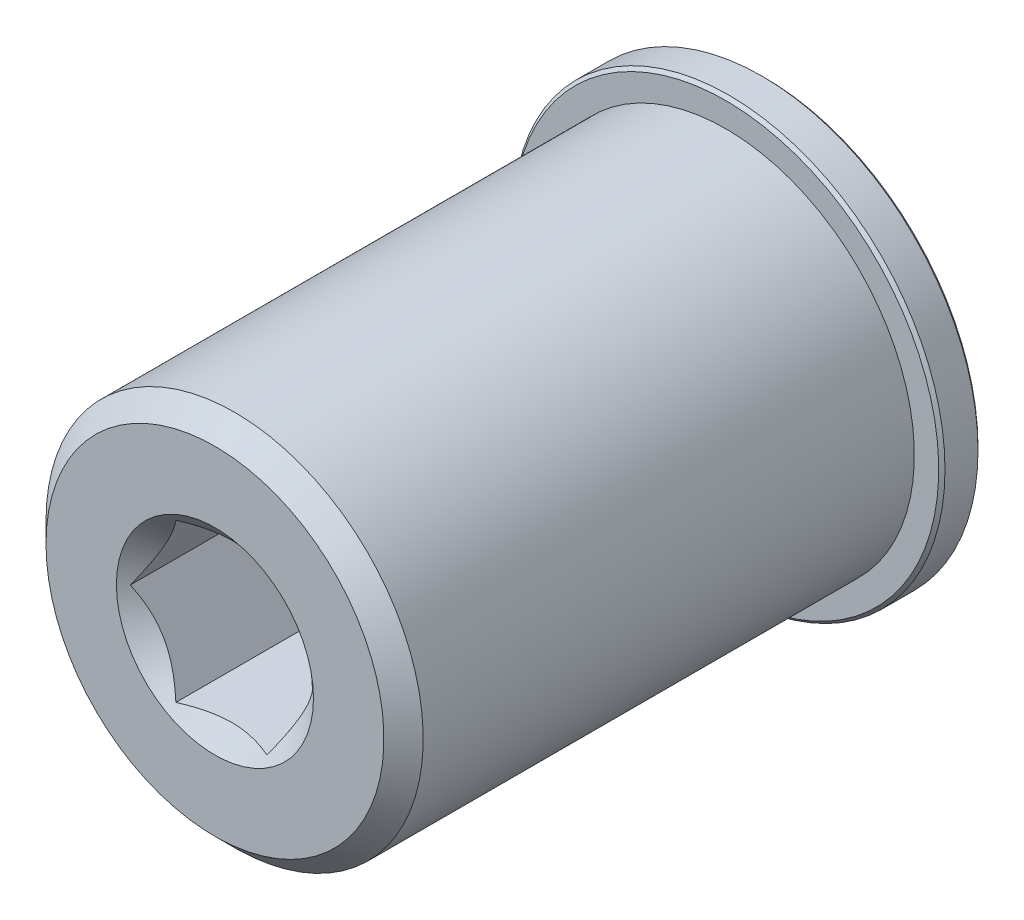
ISO-10303-21;
HEADER;
FILE_DESCRIPTION(('STEP AP214'),'2;1');
FILE_NAME('part.step','',(''),(''),'','','');
FILE_SCHEMA(('AUTOMOTIVE_DESIGN { 1 0 10303 214 1 1 1 1 }'));
ENDSEC;
DATA;
#1=APPLICATION_CONTEXT('core data for automotive mechanical design processes');
#2=APPLICATION_PROTOCOL_DEFINITION('international standard','automotive_design',2000,#1);
#3=PRODUCT_CONTEXT('',#1,'mechanical');
#4=PRODUCT('Part','Part','',(#3));
#5=PRODUCT_RELATED_PRODUCT_CATEGORY('part','',(#4));
#6=PRODUCT_DEFINITION_FORMATION('','',#4);
#7=PRODUCT_DEFINITION_CONTEXT('part definition',#1,'design');
#8=PRODUCT_DEFINITION('design','',#6,#7);
#9=PRODUCT_DEFINITION_SHAPE('','',#8);
#10=(LENGTH_UNIT() NAMED_UNIT(*) SI_UNIT(.MILLI.,.METRE.));
#11=(NAMED_UNIT(*) PLANE_ANGLE_UNIT() SI_UNIT($,.RADIAN.));
#12=(NAMED_UNIT(*) SI_UNIT($,.STERADIAN.) SOLID_ANGLE_UNIT());
#13=UNCERTAINTY_MEASURE_WITH_UNIT(LENGTH_MEASURE(1.E-05),#10,'distance_accuracy_value','');
#14=(GEOMETRIC_REPRESENTATION_CONTEXT(3) GLOBAL_UNCERTAINTY_ASSIGNED_CONTEXT((#13)) GLOBAL_UNIT_ASSIGNED_CONTEXT((#10,
#11,#12)) REPRESENTATION_CONTEXT('',''));
#15=CARTESIAN_POINT('',(0.,0.,0.));
#16=DIRECTION('',(0.,0.,1.));
#17=DIRECTION('',(1.,0.,0.));
#18=AXIS2_PLACEMENT_3D('',#15,#16,#17);
#19=CARTESIAN_POINT('',(0.,0.,-4.7625));
#20=DIRECTION('',(0.,0.,1.));
#21=DIRECTION('',(1.,0.,0.));
#22=AXIS2_PLACEMENT_3D('',#19,#20,#21);
#23=CYLINDRICAL_SURFACE('',#22,9.525);
#24=CARTESIAN_POINT('',(0.,0.,-2.38125));
#25=DIRECTION('',(0.,0.,1.));
#26=DIRECTION('',(1.,0.,0.));
#27=AXIS2_PLACEMENT_3D('',#24,#25,#26);
#28=CIRCLE('',#27,9.525);
#29=CARTESIAN_POINT('',(9.525,0.,-2.38125));
#30=VERTEX_POINT('',#29);
#31=EDGE_CURVE('E132',#30,#30,#28,.F.);
#32=ORIENTED_EDGE('',*,*,#31,.T.);
#33=EDGE_LOOP('',(#32));
#34=FACE_BOUND('',#33,.T.);
#35=CARTESIAN_POINT('',(0.,0.,-4.7625));
#36=DIRECTION('',(0.,0.,1.));
#37=DIRECTION('',(1.,0.,0.));
#38=AXIS2_PLACEMENT_3D('',#35,#36,#37);
#39=CIRCLE('',#38,9.525);
#40=CARTESIAN_POINT('',(9.525,0.,-4.7625));
#41=VERTEX_POINT('',#40);
#42=EDGE_CURVE('E139',#41,#41,#39,.F.);
#43=ORIENTED_EDGE('',*,*,#42,.F.);
#44=EDGE_LOOP('',(#43));
#45=FACE_BOUND('',#44,.T.);
#46=ADVANCED_FACE('F17',(#34,#45),#23,.T.);
#47=CARTESIAN_POINT('',(0.,0.,-4.7625));
#48=DIRECTION('',(0.,0.,-1.));
#49=DIRECTION('',(-1.,0.,0.));
#50=AXIS2_PLACEMENT_3D('',#47,#48,#49);
#51=PLANE('',#50);
#52=ORIENTED_EDGE('',*,*,#42,.T.);
#53=EDGE_LOOP('',(#52));
#54=FACE_BOUND('',#53,.T.);
#55=CARTESIAN_POINT('',(0.,0.,-4.76250000002665));
#56=DIRECTION('',(0.,0.,-1.));
#57=DIRECTION('',(-1.,0.,0.));
#58=AXIS2_PLACEMENT_3D('',#55,#56,#57);
#59=CIRCLE('',#58,7.96289999999544);
#60=CARTESIAN_POINT('',(-7.96289999999544,0.,-4.76250000002665));
#61=VERTEX_POINT('',#60);
#62=EDGE_CURVE('E91',#61,#61,#59,.F.);
#63=ORIENTED_EDGE('',*,*,#62,.T.);
#64=EDGE_LOOP('',(#63));
#65=FACE_BOUND('',#64,.T.);
#66=ADVANCED_FACE('F126',(#54,#65),#51,.T.);
#67=CARTESIAN_POINT('',(0.,0.,-2.38125));
#68=DIRECTION('',(0.,0.,1.));
#69=DIRECTION('',(1.,0.,0.));
#70=AXIS2_PLACEMENT_3D('',#67,#68,#69);
#71=TOROIDAL_SURFACE('',#70,10.31875,0.79375);
#72=CARTESIAN_POINT('',(0.,0.,-1.5875));
#73=DIRECTION('',(0.,0.,-1.));
#74=DIRECTION('',(-1.,0.,0.));
#75=AXIS2_PLACEMENT_3D('',#72,#73,#74);
#76=CIRCLE('',#75,10.31875);
#77=CARTESIAN_POINT('',(-10.31875,0.,-1.5875));
#78=VERTEX_POINT('',#77);
#79=CARTESIAN_POINT('',(10.31875,0.,-1.5875));
#80=VERTEX_POINT('',#79);
#81=EDGE_CURVE('E80',#78,#80,#76,.T.);
#82=ORIENTED_EDGE('',*,*,#81,.T.);
#83=CARTESIAN_POINT('',(0.,0.,-1.5875));
#84=DIRECTION('',(0.,0.,-1.));
#85=DIRECTION('',(1.,0.,0.));
#86=AXIS2_PLACEMENT_3D('',#83,#84,#85);
#87=CIRCLE('',#86,10.31875);
#88=EDGE_CURVE('E77',#80,#78,#87,.T.);
#89=ORIENTED_EDGE('',*,*,#88,.T.);
#90=EDGE_LOOP('',(#82,#89));
#91=FACE_BOUND('',#90,.T.);
#92=ORIENTED_EDGE('',*,*,#31,.F.);
#93=EDGE_LOOP('',(#92));
#94=FACE_BOUND('',#93,.T.);
#95=ADVANCED_FACE('F82',(#91,#94),#71,.F.);
#96=CARTESIAN_POINT('',(0.,0.,-4.76250000002665));
#97=DIRECTION('',(0.,0.,-1.));
#98=DIRECTION('',(-1.,0.,0.));
#99=AXIS2_PLACEMENT_3D('',#96,#97,#98);
#100=CONICAL_SURFACE('',#99,7.96289999999544,0.855211333477452);
#101=CARTESIAN_POINT('',(-7.3616778123846,-2.63528657081422E-12,-4.23986552585593));
#102=CARTESIAN_POINT('',(-7.29004239027056,0.124076190720529,-4.17760950951665));
#103=CARTESIAN_POINT('',(-7.21792012000924,0.248995627170353,-4.11762732986379));
#104=CARTESIAN_POINT('',(-7.07259135551525,0.500712431075146,-4.00292131524244));
#105=CARTESIAN_POINT('',(-6.99938425231083,0.627510853300148,-3.94820057364377));
#106=CARTESIAN_POINT('',(-6.77739365970753,1.01200983849139,-3.79261125749645));
#107=CARTESIAN_POINT('',(-6.62692217510879,1.27263409490672,-3.70092335318642));
#108=CARTESIAN_POINT('',(-6.39965769697561,1.66626771778901,-3.58771533259242));
#109=CARTESIAN_POINT('',(-6.32432915845011,1.7967405737751,-3.55422930937036));
#110=CARTESIAN_POINT('',(-6.17286564439137,2.05908307561774,-3.49565360948011));
#111=CARTESIAN_POINT('',(-6.09673085582295,2.19095239764176,-3.47056202834743));
#112=CARTESIAN_POINT('',(-5.94400716513701,2.45547758942924,-3.42949545828135));
#113=CARTESIAN_POINT('',(-5.86741953841224,2.58813125014767,-3.4135015984778));
#114=CARTESIAN_POINT('',(-5.71389700672629,2.85404007513434,-3.39102574565883));
#115=CARTESIAN_POINT('',(-5.63696212735227,2.98729519508432,-3.38454306293328));
#116=CARTESIAN_POINT('',(-5.49370096180016,3.23543081257212,-3.38151546183364));
#117=CARTESIAN_POINT('',(-5.42738078688849,3.35030072508599,-3.38371880674214));
#118=CARTESIAN_POINT('',(-5.29489368860524,3.57977511065994,-3.39527039344533));
#119=CARTESIAN_POINT('',(-5.22872678424425,3.69437955079273,-3.40461947845364));
#120=CARTESIAN_POINT('',(-5.03065980502729,4.03744162209818,-3.44312816670664));
#121=CARTESIAN_POINT('',(-4.89924027787976,4.26506692022439,-3.48274997989528));
#122=CARTESIAN_POINT('',(-4.63890375189526,4.71598301029552,-3.5866639017883));
#123=CARTESIAN_POINT('',(-4.5099876714464,4.93927221154557,-3.65096489089519));
#124=CARTESIAN_POINT('',(-4.25521793266326,5.38054634334902,-3.7999586928834));
#125=CARTESIAN_POINT('',(-4.12936332427187,5.59853291944959,-3.88464508839333));
#126=CARTESIAN_POINT('',(-3.95037009848282,5.90855828072689,-4.01831099189156));
#127=CARTESIAN_POINT('',(-3.89597323215211,6.00277641698421,-4.06073329598283));
#128=CARTESIAN_POINT('',(-3.78790717201407,6.18995232371709,-4.14830750904034));
#129=CARTESIAN_POINT('',(-3.73423637395795,6.28291287283305,-4.19345148984713));
#130=CARTESIAN_POINT('',(-3.68083890619712,6.37539999999033,-4.23986552584973));
#131=B_SPLINE_CURVE_WITH_KNOTS('',3,(#101,#102,#103,#104,#105,#106,#107,#108,#109,#110,#111,
#112,#113,#114,#115,#116,#117,#118,#119,#120,#121,#122,#123,#124,#125,#126,#127,#128,#129,#130),
.UNSPECIFIED.,.F.,.F.,(4,2,2,2,2,2,2,2,2,2,2,2,2,2,4),(0.,0.468576880349405,0.937427588926757,
1.87959426250024,2.34240552649953,2.80511172023072,3.26685461664367,3.72856402776934,
4.12634319823278,4.52416931479329,5.32010098640453,6.11631933008333,6.91228734949568,
7.26257509662187,7.61188762626727),.UNSPECIFIED.);
#132=CARTESIAN_POINT('',(-7.36167781235508,0.,-4.23986552581823));
#133=VERTEX_POINT('',#132);
#134=CARTESIAN_POINT('',(-3.68083890618589,6.3754,-4.23986552585215));
#135=VERTEX_POINT('',#134);
#136=EDGE_CURVE('E180',#133,#135,#131,.T.);
#137=ORIENTED_EDGE('',*,*,#136,.F.);
#138=CARTESIAN_POINT('',(-3.68083890619944,-6.37539999999398,-4.23986552584482));
#139=CARTESIAN_POINT('',(-3.75247432831102,-6.25132380927024,-4.17760950950698));
#140=CARTESIAN_POINT('',(-3.82459659857095,-6.12640437282078,-4.11762732985486));
#141=CARTESIAN_POINT('',(-3.96992536306312,-5.87468756891757,-4.00292131523431));
#142=CARTESIAN_POINT('',(-4.04313246626713,-5.7478891466938,-3.94820057363571));
#143=CARTESIAN_POINT('',(-4.26512305886891,-5.363390161506,-3.79261125748867));
#144=CARTESIAN_POINT('',(-4.41559454346625,-5.10276590509266,-3.70092335317894));
#145=CARTESIAN_POINT('',(-4.64285902159753,-4.7091322822135,-3.58771533258501));
#146=CARTESIAN_POINT('',(-4.71818756012245,-4.57865942622847,-3.55422930936292));
#147=CARTESIAN_POINT('',(-4.86965107417998,-4.31631692438792,-3.49565360947253));
#148=CARTESIAN_POINT('',(-4.9457858627478,-4.18444760236494,-3.47056202833973));
#149=CARTESIAN_POINT('',(-5.09850955343253,-3.91992241057954,-3.42949545827333));
#150=CARTESIAN_POINT('',(-5.1750971801567,-3.78726874986216,-3.41350159846958));
#151=CARTESIAN_POINT('',(-5.32861971184147,-3.52135992487755,-3.39102574565011));
#152=CARTESIAN_POINT('',(-5.40555459121489,-3.3881048049286,-3.38454306292426));
#153=CARTESIAN_POINT('',(-5.54881575676605,-3.13996918744245,-3.38151546182399));
#154=CARTESIAN_POINT('',(-5.61513593167736,-3.02509927492921,-3.38371880673219));
#155=CARTESIAN_POINT('',(-5.74762302995989,-2.7956248893565,-3.39527039343474));
#156=CARTESIAN_POINT('',(-5.81378993432053,-2.68102044922432,-3.40461947844271));
#157=CARTESIAN_POINT('',(-6.01185691353644,-2.33795837792068,-3.4431281666947));
#158=CARTESIAN_POINT('',(-6.14327644068328,-2.11033307979566,-3.48274997988263));
#159=CARTESIAN_POINT('',(-6.40361296666646,-1.65941698972683,-3.58666390177423));
#160=CARTESIAN_POINT('',(-6.53252904711467,-1.43612778847789,-3.65096489088042));
#161=CARTESIAN_POINT('',(-6.78729878589651,-0.994853656676678,-3.79995869286725));
#162=CARTESIAN_POINT('',(-6.91315339428726,-0.776867080577217,-3.88464508837652));
#163=CARTESIAN_POINT('',(-7.09214662007977,-0.466841719293955,-4.01831099187708));
#164=CARTESIAN_POINT('',(-7.14654348641451,-0.372623583029643,-4.06073329597159));
#165=CARTESIAN_POINT('',(-7.25460954656051,-0.185447676282974,-4.14830750903599));
#166=CARTESIAN_POINT('',(-7.30828034462056,-0.0924871271602104,-4.19345148984644));
#167=CARTESIAN_POINT('',(-7.36167781238526,3.78631816897511E-12,-4.23986552585288));
#168=B_SPLINE_CURVE_WITH_KNOTS('',3,(#138,#139,#140,#141,#142,#143,#144,#145,#146,#147,#148,
#149,#150,#151,#152,#153,#154,#155,#156,#157,#158,#159,#160,#161,#162,#163,#164,#165,#166,#167),
.UNSPECIFIED.,.F.,.F.,(4,2,2,2,2,2,2,2,2,2,2,2,2,2,4),(0.,0.468576880345747,0.937427588919474,
1.87959426248574,2.34240552648152,2.80511172020919,3.26685461661863,3.72856402774079,
4.12634319820204,4.52416931476037,5.32010098636724,6.11631933004176,6.91228734944982,
7.26257509660209,7.61188762627343),.UNSPECIFIED.);
#169=CARTESIAN_POINT('',(-3.68083890618905,-6.37539999999568,-4.23986552584667));
#170=VERTEX_POINT('',#169);
#171=EDGE_CURVE('E204',#170,#133,#168,.T.);
#172=ORIENTED_EDGE('',*,*,#171,.F.);
#173=CARTESIAN_POINT('',(3.68083890618237,-6.37540000000384,-4.23986552584482));
#174=CARTESIAN_POINT('',(3.53756806195502,-6.37540000000141,-4.17760950950698));
#175=CARTESIAN_POINT('',(3.3933235214334,-6.37540000000039,-4.11762732985486));
#176=CARTESIAN_POINT('',(3.10266599244773,-6.37539999999961,-4.00292131523432));
#177=CARTESIAN_POINT('',(2.95625178604016,-6.37539999999987,-3.94820057363573));
#178=CARTESIAN_POINT('',(2.51227060083732,-6.37540000000027,-3.79261125748869));
#179=CARTESIAN_POINT('',(2.21132763164229,-6.37540000000005,-3.70092335317896));
#180=CARTESIAN_POINT('',(1.75679867537959,-6.37539999999998,-3.58771533258503));
#181=CARTESIAN_POINT('',(1.60614159832978,-6.37539999999999,-3.55422930936294));
#182=CARTESIAN_POINT('',(1.30321457021472,-6.37540000000001,-3.49565360947254));
#183=CARTESIAN_POINT('',(1.15094499307908,-6.3754,-3.47056202833974));
#184=CARTESIAN_POINT('',(0.845497611709588,-6.3754,-3.42949545827333));
#185=CARTESIAN_POINT('',(0.692322358261239,-6.3754,-3.41350159846958));
#186=CARTESIAN_POINT('',(0.385277294891703,-6.3754,-3.39102574565011));
#187=CARTESIAN_POINT('',(0.231407536144847,-6.3754,-3.38454306292426));
#188=CARTESIAN_POINT('',(-0.055114794957487,-6.3754,-3.38151546182399));
#189=CARTESIAN_POINT('',(-0.187755144780104,-6.3754,-3.38371880673219));
#190=CARTESIAN_POINT('',(-0.452729341345175,-6.3754,-3.39527039343474));
#191=CARTESIAN_POINT('',(-0.585063150066458,-6.3754,-3.40461947844272));
#192=CARTESIAN_POINT('',(-0.981197108498285,-6.3754,-3.44312816669471));
#193=CARTESIAN_POINT('',(-1.24403616279199,-6.3754,-3.48274997988264));
#194=CARTESIAN_POINT('',(-1.76470921475833,-6.3754,-3.58666390177424));
#195=CARTESIAN_POINT('',(-2.02254137565474,-6.3754,-3.65096489088043));
#196=CARTESIAN_POINT('',(-2.53208085321843,-6.3754,-3.79995869286725));
#197=CARTESIAN_POINT('',(-2.78379006999992,-6.3754,-3.88464508837652));
#198=CARTESIAN_POINT('',(-3.14177652158248,-6.3754,-4.01831099187618));
#199=CARTESIAN_POINT('',(-3.25057025424957,-6.3754,-4.0607332959697));
#200=CARTESIAN_POINT('',(-3.46670237453683,-6.3754,-4.14830750903204));
#201=CARTESIAN_POINT('',(-3.57404397065458,-6.3754,-4.1934514898414));
#202=CARTESIAN_POINT('',(-3.68083890618168,-6.3754,-4.23986552584669));
#203=B_SPLINE_CURVE_WITH_KNOTS('',3,(#173,#174,#175,#176,#177,#178,#179,#180,#181,#182,#183,
#184,#185,#186,#187,#188,#189,#190,#191,#192,#193,#194,#195,#196,#197,#198,#199,#200,#201,#202),
.UNSPECIFIED.,.F.,.F.,(4,2,2,2,2,2,2,2,2,2,2,2,2,2,4),(0.,0.468576880345723,0.937427588919427,
1.87959426248564,2.34240552648145,2.80511172020915,3.26685461661861,3.72856402774079,
4.12634319820205,4.52416931476039,5.32010098636729,6.11631933004178,6.91228734944981,
7.26257509659431,7.61188762625791),.UNSPECIFIED.);
#204=CARTESIAN_POINT('',(3.68083890618655,-6.3754,-4.23986552584883));
#205=VERTEX_POINT('',#204);
#206=EDGE_CURVE('E69',#205,#170,#203,.T.);
#207=ORIENTED_EDGE('',*,*,#206,.F.);
#208=CARTESIAN_POINT('',(7.36167781238526,3.77757446666981E-12,-4.23986552585289));
#209=CARTESIAN_POINT('',(7.29004239027164,-0.124076190718656,-4.17760950951353));
#210=CARTESIAN_POINT('',(7.21792012001074,-0.248995627167748,-4.11762732986058));
#211=CARTESIAN_POINT('',(7.0725913555176,-0.50071243107108,-4.00292131523899));
#212=CARTESIAN_POINT('',(6.9993842523136,-0.62751085329535,-3.94820057364019));
#213=CARTESIAN_POINT('',(6.77739365971156,-1.0120098384844,-3.79261125749238));
#214=CARTESIAN_POINT('',(6.62692217511366,-1.27263409489828,-3.70092335318193));
#215=CARTESIAN_POINT('',(6.39965769698172,-1.66626771777843,-3.58771533258715));
#216=CARTESIAN_POINT('',(6.32432915845662,-1.79674057376382,-3.5542293093648));
#217=CARTESIAN_POINT('',(6.17286564439869,-2.05908307560508,-3.49565360947393));
#218=CARTESIAN_POINT('',(6.09673085583066,-2.19095239762841,-3.47056202834091));
#219=CARTESIAN_POINT('',(5.9440071651455,-2.45547758941454,-3.4294954582741));
#220=CARTESIAN_POINT('',(5.86741953842112,-2.58813125013229,-3.41350159847017));
#221=CARTESIAN_POINT('',(5.71389700673592,-2.85404007511766,-3.39102574565039));
#222=CARTESIAN_POINT('',(5.63696212736228,-2.98729519506699,-3.38454306292441));
#223=CARTESIAN_POINT('',(5.49370096181078,-3.23543081255373,-3.38151546182395));
#224=CARTESIAN_POINT('',(5.42738078689935,-3.35030072506717,-3.38371880673207));
#225=CARTESIAN_POINT('',(5.29489368861659,-3.57977511064029,-3.3952703934345));
#226=CARTESIAN_POINT('',(5.22872678425583,-3.69437955077268,-3.40461947844243));
#227=CARTESIAN_POINT('',(5.03065980503956,-4.03744162207693,-3.44312816669432));
#228=CARTESIAN_POINT('',(4.89924027789248,-4.26506692020236,-3.48274997988223));
#229=CARTESIAN_POINT('',(4.63890375190885,-4.71598301027199,-3.58666390177389));
#230=CARTESIAN_POINT('',(4.50998767146042,-4.93927221152131,-3.65096489088016));
#231=CARTESIAN_POINT('',(4.25521793267813,-5.38054634332328,-3.79995869286722));
#232=CARTESIAN_POINT('',(4.12936332428717,-5.59853291942311,-3.88464508837664));
#233=CARTESIAN_POINT('',(3.95037009849574,-5.90855828070451,-4.01831099187643));
#234=CARTESIAN_POINT('',(3.89597323216226,-6.00277641696662,-4.06073329596991));
#235=CARTESIAN_POINT('',(3.78790717201876,-6.18995232370896,-4.14830750903215));
#236=CARTESIAN_POINT('',(3.73423637395995,-6.28291287282958,-4.19345148984145));
#237=CARTESIAN_POINT('',(3.68083890619647,-6.37539999999146,-4.23986552584669));
#238=B_SPLINE_CURVE_WITH_KNOTS('',3,(#208,#209,#210,#211,#212,#213,#214,#215,#216,#217,#218,
#219,#220,#221,#222,#223,#224,#225,#226,#227,#228,#229,#230,#231,#232,#233,#234,#235,#236,#237),
.UNSPECIFIED.,.F.,.F.,(4,2,2,2,2,2,2,2,2,2,2,2,2,2,4),(0.,0.468576880347178,0.937427588922303,
1.87959426249134,2.34240552648846,2.80511172021746,3.26685461662824,3.72856402775173,
4.12634319821368,4.52416931477271,5.32010098638097,6.11631933005684,6.91228734946625,
7.26257509661032,7.6118876262735),.UNSPECIFIED.);
#239=CARTESIAN_POINT('',(7.36167781234787,0.,-4.23986552581823));
#240=VERTEX_POINT('',#239);
#241=EDGE_CURVE('E258',#240,#205,#238,.T.);
#242=ORIENTED_EDGE('',*,*,#241,.F.);
#243=CARTESIAN_POINT('',(3.68083890620049,6.37539999999319,-4.23986552584761));
#244=CARTESIAN_POINT('',(3.75247432831225,6.25132380926849,-4.17760950951));
#245=CARTESIAN_POINT('',(3.8245965985725,6.1264043728182,-4.11762732985804));
#246=CARTESIAN_POINT('',(3.96992536306545,5.87468756891344,-4.00292131523777));
#247=CARTESIAN_POINT('',(4.04313246626992,5.74788914668895,-3.94820057363929));
#248=CARTESIAN_POINT('',(4.26512305887301,5.36339016149897,-3.79261125749269));
#249=CARTESIAN_POINT('',(4.41559454347118,5.10276590508412,-3.70092335318339));
#250=CARTESIAN_POINT('',(4.64285902160372,4.70913228220278,-3.58771533259025));
#251=CARTESIAN_POINT('',(4.71818756012905,4.57865942621704,-3.55422930936844));
#252=CARTESIAN_POINT('',(4.8696510741874,4.31631692437508,-3.49565360947867));
#253=CARTESIAN_POINT('',(4.94578586275562,4.1844476023514,-3.47056202834622));
#254=CARTESIAN_POINT('',(5.09850955344115,3.91992241056462,-3.42949545828055));
#255=CARTESIAN_POINT('',(5.17509718016571,3.78726874984656,-3.41350159847718));
#256=CARTESIAN_POINT('',(5.32861971185125,3.52135992486061,-3.39102574565854));
#257=CARTESIAN_POINT('',(5.40555459122505,3.388104804911,-3.38454306293312));
#258=CARTESIAN_POINT('',(5.54881575677683,3.13996918742377,-3.38151546183368));
#259=CARTESIAN_POINT('',(5.61513593168839,3.02509927491011,-3.38371880674226));
#260=CARTESIAN_POINT('',(5.7476230299714,2.79562488933656,-3.39527039344558));
#261=CARTESIAN_POINT('',(5.81378993433227,2.68102044920398,-3.40461947845395));
#262=CARTESIAN_POINT('',(6.01185691354887,2.33795837789913,-3.44312816670707));
#263=CARTESIAN_POINT('',(6.14327644069617,2.11033307977334,-3.48274997989574));
#264=CARTESIAN_POINT('',(6.40361296668021,1.65941698970301,-3.58666390178871));
#265=CARTESIAN_POINT('',(6.53252904712885,1.43612778845333,-3.65096489089554));
#266=CARTESIAN_POINT('',(6.78729878591155,0.994853656650642,-3.79995869288353));
#267=CARTESIAN_POINT('',(6.91315339430272,0.776867080550441,-3.88464508839333));
#268=CARTESIAN_POINT('',(7.09214662009283,0.466841719271337,-4.01831099189232));
#269=CARTESIAN_POINT('',(7.14654348642477,0.372623583011873,-4.06073329598459));
#270=CARTESIAN_POINT('',(7.25460954656526,0.185447676274758,-4.14830750904423));
#271=CARTESIAN_POINT('',(7.30828034462258,0.0924871271567012,-4.19345148985214));
#272=CARTESIAN_POINT('',(7.3616778123846,-2.64231672638382E-12,-4.23986552585591));
#273=B_SPLINE_CURVE_WITH_KNOTS('',3,(#243,#244,#245,#246,#247,#248,#249,#250,#251,#252,#253,
#254,#255,#256,#257,#258,#259,#260,#261,#262,#263,#264,#265,#266,#267,#268,#269,#270,#271,#272),
.UNSPECIFIED.,.F.,.F.,(4,2,2,2,2,2,2,2,2,2,2,2,2,2,4),(0.,0.468576880348005,0.937427588923997,
1.87959426249479,2.3424055264928,2.80511172022269,3.26685461663435,3.72856402775872,
4.12634319822147,4.52416931478129,5.32010098639115,6.11631933006861,6.91228734947962,
7.26257509661382,7.61188762626719),.UNSPECIFIED.);
#274=CARTESIAN_POINT('',(3.68083890619436,6.37539999999511,-4.23986552585215));
#275=VERTEX_POINT('',#274);
#276=EDGE_CURVE('E198',#275,#240,#273,.T.);
#277=ORIENTED_EDGE('',*,*,#276,.F.);
#278=CARTESIAN_POINT('',(-3.68083890618116,6.37540000000434,-4.23986552584761));
#279=CARTESIAN_POINT('',(-3.53756806195289,6.3754000000016,-4.17760950951));
#280=CARTESIAN_POINT('',(-3.39332352143039,6.37540000000044,-4.11762732985804));
#281=CARTESIAN_POINT('',(-3.10266599244299,6.37539999999956,-4.00292131523778));
#282=CARTESIAN_POINT('',(-2.95625178603457,6.37539999999985,-3.9482005736393));
#283=CARTESIAN_POINT('',(-2.51227060082918,6.3754000000003,-3.79261125749271));
#284=CARTESIAN_POINT('',(-2.21132763163243,6.37540000000006,-3.70092335318341));
#285=CARTESIAN_POINT('',(-1.75679867536722,6.37539999999998,-3.58771533259027));
#286=CARTESIAN_POINT('',(-1.60614159831659,6.37539999999999,-3.55422930936846));
#287=CARTESIAN_POINT('',(-1.3032145701999,6.37540000000001,-3.49565360947868));
#288=CARTESIAN_POINT('',(-1.15094499306344,6.3754,-3.47056202834623));
#289=CARTESIAN_POINT('',(-0.84549761169236,6.3754,-3.42949545828055));
#290=CARTESIAN_POINT('',(-0.692322358243226,6.3754,-3.41350159847719));
#291=CARTESIAN_POINT('',(-0.385277294872146,6.3754,-3.39102574565854));
#292=CARTESIAN_POINT('',(-0.23140753612453,6.3754,-3.38454306293312));
#293=CARTESIAN_POINT('',(0.0551147949790487,6.3754,-3.38151546183368));
#294=CARTESIAN_POINT('',(0.187755144802155,6.3754,-3.38371880674226));
#295=CARTESIAN_POINT('',(0.452729341368187,6.3754,-3.39527039344559));
#296=CARTESIAN_POINT('',(0.58506315008994,6.3754,-3.40461947845395));
#297=CARTESIAN_POINT('',(0.981197108523156,6.3754,-3.44312816670708));
#298=CARTESIAN_POINT('',(1.24403616281776,6.3754,-3.48274997989575));
#299=CARTESIAN_POINT('',(1.76470921478584,6.3754,-3.58666390178872));
#300=CARTESIAN_POINT('',(2.0225413756831,6.3754,-3.65096489089554));
#301=CARTESIAN_POINT('',(2.53208085324849,6.3754,-3.79995869288354));
#302=CARTESIAN_POINT('',(2.78379007003083,6.3754,-3.88464508839333));
#303=CARTESIAN_POINT('',(3.1417765216086,6.3754,-4.01831099189141));
#304=CARTESIAN_POINT('',(3.25057025427009,6.3754,-4.06073329598271));
#305=CARTESIAN_POINT('',(3.46670237454633,6.3754,-4.14830750904028));
#306=CARTESIAN_POINT('',(3.57404397065864,6.3754,-4.1934514898471));
#307=CARTESIAN_POINT('',(3.68083890618037,6.3754,-4.23986552584974));
#308=B_SPLINE_CURVE_WITH_KNOTS('',3,(#278,#279,#280,#281,#282,#283,#284,#285,#286,#287,#288,
#289,#290,#291,#292,#293,#294,#295,#296,#297,#298,#299,#300,#301,#302,#303,#304,#305,#306,#307),
.UNSPECIFIED.,.F.,.F.,(4,2,2,2,2,2,2,2,2,2,2,2,2,2,4),(0.,0.468576880347981,0.937427588923948,
1.87959426249469,2.34240552649272,2.80511172022264,3.26685461663432,3.72856402775872,
4.12634319822148,4.5241693147813,5.32010098639119,6.11631933006863,6.91228734947961,
7.26257509660604,7.61188762625168),.UNSPECIFIED.);
#309=EDGE_CURVE('E190',#135,#275,#308,.T.);
#310=ORIENTED_EDGE('',*,*,#309,.F.);
#311=EDGE_LOOP('',(#137,#172,#207,#242,#277,#310));
#312=FACE_BOUND('',#311,.T.);
#313=ORIENTED_EDGE('',*,*,#62,.F.);
#314=EDGE_LOOP('',(#313));
#315=FACE_BOUND('',#314,.T.);
#316=ADVANCED_FACE('F110',(#312,#315),#100,.F.);
#317=CARTESIAN_POINT('',(0.,0.,-1.5875));
#318=DIRECTION('',(0.,0.,1.));
#319=DIRECTION('',(1.,0.,0.));
#320=AXIS2_PLACEMENT_3D('',#317,#318,#319);
#321=PLANE('',#320);
#322=ORIENTED_EDGE('',*,*,#88,.F.);
#323=ORIENTED_EDGE('',*,*,#81,.F.);
#324=EDGE_LOOP('',(#322,#323));
#325=FACE_BOUND('',#324,.T.);
#326=CARTESIAN_POINT('',(0.,0.,-1.5875));
#327=DIRECTION('',(0.,0.,1.));
#328=DIRECTION('',(1.,0.,0.));
#329=AXIS2_PLACEMENT_3D('',#326,#327,#328);
#330=CIRCLE('',#329,17.2085);
#331=CARTESIAN_POINT('',(17.2085,0.,-1.5875));
#332=VERTEX_POINT('',#331);
#333=EDGE_CURVE('E188',#332,#332,#330,.T.);
#334=ORIENTED_EDGE('',*,*,#333,.F.);
#335=EDGE_LOOP('',(#334));
#336=FACE_BOUND('',#335,.T.);
#337=ADVANCED_FACE('F89',(#325,#336),#321,.F.);
#338=CARTESIAN_POINT('',(3.68083890619154,-6.3754,-4.7625));
#339=DIRECTION('',(0.,1.,0.));
#340=DIRECTION('',(-1.,0.,0.));
#341=AXIS2_PLACEMENT_3D('',#338,#339,#340);
#342=PLANE('',#341);
#343=ORIENTED_EDGE('',*,*,#206,.T.);
#344=DIRECTION('',(0.,0.,1.));
#345=VECTOR('',#344,1.);
#346=CARTESIAN_POINT('',(-3.68083890619154,-6.3754,-4.7625));
#347=LINE('',#346,#345);
#348=CARTESIAN_POINT('',(-3.680838901253,-6.37540000855381,42.3398655300844));
#349=VERTEX_POINT('',#348);
#350=EDGE_CURVE('E256',#349,#170,#347,.F.);
#351=ORIENTED_EDGE('',*,*,#350,.F.);
#352=CARTESIAN_POINT('',(-3.68083883074579,-6.37539999999488,42.3398654930023));
#353=CARTESIAN_POINT('',(-3.53756798891934,-6.37539999999812,42.2776094786603));
#354=CARTESIAN_POINT('',(-3.39332345082502,-6.37539999999948,42.2176273009769));
#355=CARTESIAN_POINT('',(-3.10266592676703,-6.37540000000052,42.1029212902102));
#356=CARTESIAN_POINT('',(-2.95625172285992,-6.37540000000018,42.0482005504965));
#357=CARTESIAN_POINT('',(-2.51227054540028,-6.37539999999964,41.8926112398764));
#358=CARTESIAN_POINT('',(-2.2113275815788,-6.37539999999994,41.8009233390215));
#359=CARTESIAN_POINT('',(-1.75679863347065,-6.37540000000003,41.6877153228819));
#360=CARTESIAN_POINT('',(-1.60614155905243,-6.37540000000001,41.654229301003));
#361=CARTESIAN_POINT('',(-1.30321453628723,-6.37539999999999,41.5956536035478));
#362=CARTESIAN_POINT('',(-1.15094496186983,-6.3754,41.5705620235071));
#363=CARTESIAN_POINT('',(-0.845497585986935,-6.3754,41.5294954553207));
#364=CARTESIAN_POINT('',(-0.69232233530663,-6.3754,41.5135015963067));
#365=CARTESIAN_POINT('',(-0.385277277523462,-6.3754,41.4910257447309));
#366=CARTESIAN_POINT('',(-0.23140752159492,-6.3754,41.4845430624592));
#367=CARTESIAN_POINT('',(0.0551148054292173,-6.3754,41.48151546186));
#368=CARTESIAN_POINT('',(0.18775515399494,-6.3754,41.4837188069255));
#369=CARTESIAN_POINT('',(0.452729348044416,-6.3754,41.495270393805));
#370=CARTESIAN_POINT('',(0.585063155506996,-6.3754,41.5046194788325));
#371=CARTESIAN_POINT('',(0.981197110168849,-6.3754,41.5431281669396));
#372=CARTESIAN_POINT('',(1.24403616196389,-6.3754,41.5827499797592));
#373=CARTESIAN_POINT('',(1.76470920899562,-6.3754,41.6866639004534));
#374=CARTESIAN_POINT('',(2.02254136745695,-6.3754,41.7509648887263));
#375=CARTESIAN_POINT('',(2.53208084027555,-6.3754,41.8999586887135));
#376=CARTESIAN_POINT('',(2.78379005474705,-6.3754,41.9846450830563));
#377=CARTESIAN_POINT('',(3.14177649418395,-6.3754,42.1183109813927));
#378=CARTESIAN_POINT('',(3.25057021706934,-6.3754,42.1607332813234));
#379=CARTESIAN_POINT('',(3.46670231805246,-6.3754,42.2483074856076));
#380=CARTESIAN_POINT('',(3.57404390464691,-6.3754,42.2934514618037));
#381=CARTESIAN_POINT('',(3.68083883074587,-6.3754,42.3398654929994));
#382=B_SPLINE_CURVE_WITH_KNOTS('',3,(#352,#353,#354,#355,#356,#357,#358,#359,#360,#361,#362,
#363,#364,#365,#366,#367,#368,#369,#370,#371,#372,#373,#374,#375,#376,#377,#378,#379,#380,#381),
.UNSPECIFIED.,.F.,.F.,(4,2,2,2,2,2,2,2,2,2,2,2,2,2,4),(0.,0.468576871355203,0.937427570922881,
1.8795942261017,2.34240548152466,2.80511166668531,3.26685455460365,3.72856395723822,
4.12634312394245,4.52416923674321,5.32010090081564,6.11631923682325,6.91228724855926,
7.26257496383553,7.61188746180825),.UNSPECIFIED.);
#383=CARTESIAN_POINT('',(3.68083886846876,-6.3754,42.3398655093954));
#384=VERTEX_POINT('',#383);
#385=EDGE_CURVE('E235',#349,#384,#382,.T.);
#386=ORIENTED_EDGE('',*,*,#385,.T.);
#387=DIRECTION('',(0.,0.,1.));
#388=VECTOR('',#387,1.);
#389=CARTESIAN_POINT('',(3.68083890619154,-6.3754,-4.7625));
#390=LINE('',#389,#388);
#391=EDGE_CURVE('E94',#205,#384,#390,.T.);
#392=ORIENTED_EDGE('',*,*,#391,.F.);
#393=EDGE_LOOP('',(#343,#351,#386,#392));
#394=FACE_BOUND('',#393,.T.);
#395=ADVANCED_FACE('F109',(#394),#342,.T.);
#396=CARTESIAN_POINT('',(7.36167781238308,0.,-4.7625));
#397=DIRECTION('',(-0.866025403784439,0.5,0.));
#398=DIRECTION('',(-0.5,-0.866025403784439,0.));
#399=AXIS2_PLACEMENT_3D('',#396,#397,#398);
#400=PLANE('',#399);
#401=ORIENTED_EDGE('',*,*,#241,.T.);
#402=ORIENTED_EDGE('',*,*,#391,.T.);
#403=CARTESIAN_POINT('',(3.68083889631401,-6.37540001710838,42.3398655343778));
#404=CARTESIAN_POINT('',(3.75247431873625,-6.25132382585141,42.2776095175194));
#405=CARTESIAN_POINT('',(3.82459658930924,-6.12640438886175,42.2176273373547));
#406=CARTESIAN_POINT('',(3.96992535443604,-5.87468758386089,42.1029213217309));
#407=CARTESIAN_POINT('',(4.04313245796162,-5.74788916107963,42.0482005796418));
#408=CARTESIAN_POINT('',(4.26512305155985,-5.36339017416513,41.8926112620549));
#409=CARTESIAN_POINT('',(4.41559453684922,-5.10276591655358,41.8009233568429));
#410=CARTESIAN_POINT('',(4.642859016041,-4.70913229183774,41.6877153350771));
#411=CARTESIAN_POINT('',(4.71818755491518,-4.57865943524774,41.6542293114984));
#412=CARTESIAN_POINT('',(4.86965106968276,-4.31631693217733,41.5956536109616));
#413=CARTESIAN_POINT('',(4.94578585861136,-4.18444760952946,41.5705620295389));
#414=CARTESIAN_POINT('',(5.09850955002431,-3.91992241648276,41.5294954589736));
#415=CARTESIAN_POINT('',(5.17509717711587,-3.78726875512904,41.5135015989603));
#416=CARTESIAN_POINT('',(5.32861970954207,-3.52135992886021,41.491025745811));
#417=CARTESIAN_POINT('',(5.40555458928956,-3.38810480826337,41.4845430629647));
#418=CARTESIAN_POINT('',(5.54881575538225,-3.13996918983926,41.4815154617319));
#419=CARTESIAN_POINT('',(5.61513593046064,-3.02509927703663,41.4837188065986));
#420=CARTESIAN_POINT('',(5.74762302907756,-2.79562489088473,41.4952703932548));
#421=CARTESIAN_POINT('',(5.81378993360551,-2.68102045046276,41.5046194782579));
#422=CARTESIAN_POINT('',(6.01185691332269,-2.3379583782909,41.5431281665497));
#423=CARTESIAN_POINT('',(6.14327644080181,-2.11033307959037,41.5827499798365));
#424=CARTESIAN_POINT('',(6.40361296743031,-1.65941698840381,41.6866639020442));
#425=CARTESIAN_POINT('',(6.53252904819166,-1.43612778661248,41.7509648913666));
#426=CARTESIAN_POINT('',(6.7872987875833,-0.99485365375508,41.8999586938714));
#427=CARTESIAN_POINT('',(6.9131533962707,-0.776867077141803,41.9846450896822));
#428=CARTESIAN_POINT('',(7.09214662196354,-0.466841716031167,42.1183109932727));
#429=CARTESIAN_POINT('',(7.14654348791381,-0.372623580432789,42.1607332971029));
#430=CARTESIAN_POINT('',(7.25460954730126,-0.185447674999973,42.2483075095988));
#431=CARTESIAN_POINT('',(7.30828034498719,-0.09248712652519,42.2934514901052));
#432=CARTESIAN_POINT('',(7.36167781238166,-2.45938711334478E-12,42.3398655257901));
#433=B_SPLINE_CURVE_WITH_KNOTS('',3,(#403,#404,#405,#406,#407,#408,#409,#410,#411,#412,#413,
#414,#415,#416,#417,#418,#419,#420,#421,#422,#423,#424,#425,#426,#427,#428,#429,#430,#431,#432),
.UNSPECIFIED.,.F.,.F.,(4,2,2,2,2,2,2,2,2,2,2,2,2,2,4),(0.,0.468576882665501,0.937427593562873,
1.87959427187514,2.34240553814658,2.80511173414838,3.26685463281174,3.72856404618689,
4.12634321764701,4.52416933520435,5.32010100881536,6.11631935446361,6.91228737584268,
7.26257512055856,7.61188764780811),.UNSPECIFIED.);
#434=CARTESIAN_POINT('',(7.3616778123905,0.,42.339865525804));
#435=VERTEX_POINT('',#434);
#436=EDGE_CURVE('E228',#384,#435,#433,.T.);
#437=ORIENTED_EDGE('',*,*,#436,.T.);
#438=DIRECTION('',(0.,0.,1.));
#439=VECTOR('',#438,1.);
#440=CARTESIAN_POINT('',(7.36167781238308,0.,-4.7625));
#441=LINE('',#440,#439);
#442=EDGE_CURVE('E197',#240,#435,#441,.T.);
#443=ORIENTED_EDGE('',*,*,#442,.F.);
#444=EDGE_LOOP('',(#401,#402,#437,#443));
#445=FACE_BOUND('',#444,.T.);
#446=ADVANCED_FACE('F271',(#445),#400,.T.);
#447=CARTESIAN_POINT('',(-3.68083890619154,-6.3754,-4.7625));
#448=DIRECTION('',(0.866025403784439,0.5,0.));
#449=DIRECTION('',(-0.5,0.866025403784439,0.));
#450=AXIS2_PLACEMENT_3D('',#447,#448,#449);
#451=PLANE('',#450);
#452=ORIENTED_EDGE('',*,*,#171,.T.);
#453=DIRECTION('',(0.,0.,1.));
#454=VECTOR('',#453,1.);
#455=CARTESIAN_POINT('',(-7.36167781238308,0.,-4.7625));
#456=LINE('',#455,#454);
#457=CARTESIAN_POINT('',(-7.36167781237587,3.61047282739841E-13,42.3398655257994));
#458=VERTEX_POINT('',#457);
#459=EDGE_CURVE('E37',#458,#133,#456,.F.);
#460=ORIENTED_EDGE('',*,*,#459,.F.);
#461=CARTESIAN_POINT('',(-7.36167781238165,-2.46714736792454E-12,42.3398655257901));
#462=CARTESIAN_POINT('',(-7.29004239026358,-0.124076190732618,42.2776095094466));
#463=CARTESIAN_POINT('',(-7.21792011999816,-0.248995627189539,42.2176273297897));
#464=CARTESIAN_POINT('',(-7.07259135549582,-0.500712431108808,42.1029213151611));
#465=CARTESIAN_POINT('',(-6.99938425228713,-0.627510853341187,42.0482005735591));
#466=CARTESIAN_POINT('',(-6.77739365967089,-1.01200983855484,41.8926112574032));
#467=CARTESIAN_POINT('',(-6.62692217506324,-1.27263409498561,41.8009233530892));
#468=CARTESIAN_POINT('',(-6.39965769692691,-1.66626771787336,41.6877153324981));
#469=CARTESIAN_POINT('',(-6.32432915840747,-1.79674057384895,41.65422930928));
#470=CARTESIAN_POINT('',(-6.172865644361,-2.05908307567035,41.5956536093965));
#471=CARTESIAN_POINT('',(-6.09673085579878,-2.19095239768363,41.5705620282666));
#472=CARTESIAN_POINT('',(-5.94400716512529,-2.45547758944955,41.5294954582047));
#473=CARTESIAN_POINT('',(-5.86741953840676,-2.58813125015716,41.5135015984026));
#474=CARTESIAN_POINT('',(-5.71389700673334,-2.85404007512212,41.4910257455851));
#475=CARTESIAN_POINT('',(-5.63696212736562,-2.98729519506121,41.4845430628596));
#476=CARTESIAN_POINT('',(-5.49370096182307,-3.23543081253243,41.4815154617586));
#477=CARTESIAN_POINT('',(-5.42738078691469,-3.3503007250406,41.4837188066661));
#478=CARTESIAN_POINT('',(-5.29489368863797,-3.57977511060325,41.4952703933668));
#479=CARTESIAN_POINT('',(-5.22872678428022,-3.69437955073042,41.5046194783735));
#480=CARTESIAN_POINT('',(-5.0306598050731,-4.03744162201884,41.543128166621));
#481=CARTESIAN_POINT('',(-4.89924027793209,-4.26506692013375,41.5827499798048));
#482=CARTESIAN_POINT('',(-4.63890375194954,-4.71598301020151,41.6866639016907));
#483=CARTESIAN_POINT('',(-4.50998767149632,-4.93927221145911,41.7509648907975));
#484=CARTESIAN_POINT('',(-4.25521793270434,-5.38054634327788,41.8999586927876));
#485=CARTESIAN_POINT('',(-4.12936332430848,-5.5985329193862,41.9846450882997));
#486=CARTESIAN_POINT('',(-3.95037009682165,-5.90855828360412,42.1183109930651));
#487=CARTESIAN_POINT('',(-3.89597322881665,-6.0027764227614,42.160733298518));
#488=CARTESIAN_POINT('',(-3.78790716537463,-6.18995233521694,42.2483075144581));
#489=CARTESIAN_POINT('',(-3.73423636568867,-6.28291288715586,42.2934514967852));
#490=CARTESIAN_POINT('',(-3.68083889631445,-6.37540001710762,42.3398655343774));
#491=B_SPLINE_CURVE_WITH_KNOTS('',3,(#461,#462,#463,#464,#465,#466,#467,#468,#469,#470,#471,
#472,#473,#474,#475,#476,#477,#478,#479,#480,#481,#482,#483,#484,#485,#486,#487,#488,#489,#490),
.UNSPECIFIED.,.F.,.F.,(4,2,2,2,2,2,2,2,2,2,2,2,2,2,4),(0.,0.468576880376691,0.937427588981436,
1.87959426260919,2.34240552657045,2.80511172026361,3.2668546166389,3.72856402772693,
4.12634319817065,4.52416931471142,5.32010098628211,6.11631932998559,6.91228734942672,
7.26257510739306,7.61188764781725),.UNSPECIFIED.);
#492=EDGE_CURVE('E223',#458,#349,#491,.T.);
#493=ORIENTED_EDGE('',*,*,#492,.T.);
#494=ORIENTED_EDGE('',*,*,#350,.T.);
#495=EDGE_LOOP('',(#452,#460,#493,#494));
#496=FACE_BOUND('',#495,.T.);
#497=ADVANCED_FACE('F213',(#496),#451,.T.);
#498=CARTESIAN_POINT('',(3.68083890619154,6.3754,-4.7625));
#499=DIRECTION('',(-0.866025403784439,-0.5,0.));
#500=DIRECTION('',(0.5,-0.866025403784439,0.));
#501=AXIS2_PLACEMENT_3D('',#498,#499,#500);
#502=PLANE('',#501);
#503=ORIENTED_EDGE('',*,*,#276,.T.);
#504=ORIENTED_EDGE('',*,*,#442,.T.);
#505=CARTESIAN_POINT('',(7.36167781238267,7.12364033349466E-13,42.3398655257855));
#506=CARTESIAN_POINT('',(7.29004239028929,0.124076190688081,42.2776095094627));
#507=CARTESIAN_POINT('',(7.21792012004889,0.24899562710167,42.2176273298251));
#508=CARTESIAN_POINT('',(7.07259135559738,0.500712430932896,42.1029213152311));
#509=CARTESIAN_POINT('',(6.99938425241451,0.627510853120563,42.0482005736445));
#510=CARTESIAN_POINT('',(6.77739365987652,1.01200983819869,41.8926112575276));
#511=CARTESIAN_POINT('',(6.62692217532247,1.27263409453661,41.80092335323));
#512=CARTESIAN_POINT('',(6.39965769721704,1.66626771737085,41.6877153326189));
#513=CARTESIAN_POINT('',(6.32432915867354,1.7967405733881,41.6542293093794));
#514=CARTESIAN_POINT('',(6.17286564457822,2.05908307529411,41.5956536094578));
#515=CARTESIAN_POINT('',(6.09673085599121,2.19095239735033,41.5705620283114));
#516=CARTESIAN_POINT('',(5.94400716526781,2.4554775892027,41.5294954582223));
#517=CARTESIAN_POINT('',(5.86741953852417,2.5881312499538,41.5135015984094));
#518=CARTESIAN_POINT('',(5.71389700680018,2.85404007500636,41.4910257455766));
#519=CARTESIAN_POINT('',(5.636962127407,2.98729519498954,41.4845430628466));
#520=CARTESIAN_POINT('',(5.49370096182619,3.23543081252704,41.4815154617435));
#521=CARTESIAN_POINT('',(5.427380786905,3.35030072505738,41.4837188066516));
#522=CARTESIAN_POINT('',(5.29489368860277,3.57977511066422,41.4952703933562));
#523=CARTESIAN_POINT('',(5.22872678423231,3.69437955081341,41.5046194783663));
#524=CARTESIAN_POINT('',(5.03065980498642,4.03744162216899,41.5431281666282));
#525=CARTESIAN_POINT('',(4.89924027781957,4.26506692032865,41.5827499798272));
#526=CARTESIAN_POINT('',(4.63890375183849,4.71598301039385,41.6866639017316));
#527=CARTESIAN_POINT('',(4.50998767141158,4.9392722116059,41.7509648908318));
#528=CARTESIAN_POINT('',(4.25521793267281,5.38054634333249,41.8999586927992));
#529=CARTESIAN_POINT('',(4.12936332430379,5.59853291939432,41.9846450882946));
#530=CARTESIAN_POINT('',(3.95037010497144,5.90855826948826,42.1183109869709));
#531=CARTESIAN_POINT('',(3.89597324500286,6.00277639472607,42.1607332858878));
#532=CARTESIAN_POINT('',(3.78790719741962,6.18995227971339,42.248307487991));
#533=CARTESIAN_POINT('',(3.73423640555674,6.28291281810234,42.2934514630207));
#534=CARTESIAN_POINT('',(3.68083894392674,6.37539993464072,42.3398654929831));
#535=B_SPLINE_CURVE_WITH_KNOTS('',3,(#505,#506,#507,#508,#509,#510,#511,#512,#513,#514,#515,
#516,#517,#518,#519,#520,#521,#522,#523,#524,#525,#526,#527,#528,#529,#530,#531,#532,#533,#534),
.UNSPECIFIED.,.F.,.F.,(4,2,2,2,2,2,2,2,2,2,2,2,2,2,4),(0.,0.468576880216018,0.937427588659548,
1.87959426196732,2.34240552608325,2.80511171993104,3.26685461645928,3.72856402770017,
4.12634319822057,4.52416931483811,5.32010098656743,6.11631933011568,6.91228734938189,
7.26257505531624,7.61188754400301),.UNSPECIFIED.);
#536=CARTESIAN_POINT('',(3.68083892505914,6.37539996732036,42.3398655093845));
#537=VERTEX_POINT('',#536);
#538=EDGE_CURVE('E217',#435,#537,#535,.T.);
#539=ORIENTED_EDGE('',*,*,#538,.T.);
#540=DIRECTION('',(0.,0.,1.));
#541=VECTOR('',#540,1.);
#542=CARTESIAN_POINT('',(3.68083890619154,6.3754,-4.7625));
#543=LINE('',#542,#541);
#544=EDGE_CURVE('E196',#275,#537,#543,.T.);
#545=ORIENTED_EDGE('',*,*,#544,.F.);
#546=EDGE_LOOP('',(#503,#504,#539,#545));
#547=FACE_BOUND('',#546,.T.);
#548=ADVANCED_FACE('F210',(#547),#502,.T.);
#549=CARTESIAN_POINT('',(-3.68083890619154,6.3754,-4.7625));
#550=DIRECTION('',(0.,-1.,0.));
#551=DIRECTION('',(1.,0.,0.));
#552=AXIS2_PLACEMENT_3D('',#549,#550,#551);
#553=PLANE('',#552);
#554=ORIENTED_EDGE('',*,*,#309,.T.);
#555=ORIENTED_EDGE('',*,*,#544,.T.);
#556=CARTESIAN_POINT('',(3.68083892592185,6.3754,42.3398655343615));
#557=CARTESIAN_POINT('',(3.53756808111764,6.3754,42.2776095175203));
#558=CARTESIAN_POINT('',(3.39332354001243,6.3754,42.2176273373714));
#559=CARTESIAN_POINT('',(3.10266600984165,6.3754,42.1029213217764));
#560=CARTESIAN_POINT('',(2.95625180283255,6.3754,42.0482005797001));
#561=CARTESIAN_POINT('',(2.51227061576362,6.3754,41.8926112621458));
#562=CARTESIAN_POINT('',(2.21132764527226,6.3754,41.8009233569481));
#563=CARTESIAN_POINT('',(1.75679868694132,6.3754,41.6877153351677));
#564=CARTESIAN_POINT('',(1.60614160915605,6.3754,41.6542293115724));
#565=CARTESIAN_POINT('',(1.3032145795459,6.3754,41.5956536110061));
#566=CARTESIAN_POINT('',(1.15094500165063,6.3754,41.5705620295706));
#567=CARTESIAN_POINT('',(0.845497618748101,6.3754,41.5294954589841));
#568=CARTESIAN_POINT('',(0.692322364526422,6.3754,41.5135015989624));
#569=CARTESIAN_POINT('',(0.385277299596347,6.3754,41.4910257458012));
#570=CARTESIAN_POINT('',(0.231407540062282,6.3754,41.4845430629515));
#571=CARTESIAN_POINT('',(-0.0551147921819033,6.3754,41.4815154617169));
#572=CARTESIAN_POINT('',(-0.187755142358355,6.3754,41.483718806584));
#573=CARTESIAN_POINT('',(-0.452729339631427,6.3754,41.4952703932431));
#574=CARTESIAN_POINT('',(-0.585063148706875,6.3754,41.5046194782488));
#575=CARTESIAN_POINT('',(-0.981197108200882,6.3754,41.5431281665515));
#576=CARTESIAN_POINT('',(-1.24403616319889,6.3754,41.5827499798501));
#577=CARTESIAN_POINT('',(-1.76470921645124,6.3754,41.6866639020715));
#578=CARTESIAN_POINT('',(-2.02254137793115,6.3754,41.7509648913883));
#579=CARTESIAN_POINT('',(-2.53208085662788,6.3754,41.899958693874));
#580=CARTESIAN_POINT('',(-2.78379007395906,6.3754,41.984645089671));
#581=CARTESIAN_POINT('',(-3.14177651242176,6.3754,42.1183109884363));
#582=CARTESIAN_POINT('',(-3.25057023158748,6.3754,42.1607332870879));
#583=CARTESIAN_POINT('',(-3.46670232523192,6.3754,42.2483074886204));
#584=CARTESIAN_POINT('',(-3.57404390820702,6.3754,42.2934514633447));
#585=CARTESIAN_POINT('',(-3.68083883072417,6.3754,42.3398654929844));
#586=B_SPLINE_CURVE_WITH_KNOTS('',3,(#556,#557,#558,#559,#560,#561,#562,#563,#564,#565,#566,
#567,#568,#569,#570,#571,#572,#573,#574,#575,#576,#577,#578,#579,#580,#581,#582,#583,#584,#585),
.UNSPECIFIED.,.F.,.F.,(4,2,2,2,2,2,2,2,2,2,2,2,2,2,4),(0.,0.468576882534311,0.937427593300058,
1.87959427135089,2.34240553774113,2.80511173386169,3.26685463264251,3.72856404613506,
4.12634321765413,4.52416933527048,5.32010100900354,6.11631935452515,6.91228737576199,
7.26257507925182,7.61188756550871),.UNSPECIFIED.);
#587=CARTESIAN_POINT('',(-3.68083886845785,6.3754,42.3398655093851));
#588=VERTEX_POINT('',#587);
#589=EDGE_CURVE('E159',#537,#588,#586,.T.);
#590=ORIENTED_EDGE('',*,*,#589,.T.);
#591=DIRECTION('',(0.,0.,1.));
#592=VECTOR('',#591,1.);
#593=CARTESIAN_POINT('',(-3.68083890619154,6.3754,-4.7625));
#594=LINE('',#593,#592);
#595=EDGE_CURVE('E187',#135,#588,#594,.T.);
#596=ORIENTED_EDGE('',*,*,#595,.F.);
#597=EDGE_LOOP('',(#554,#555,#590,#596));
#598=FACE_BOUND('',#597,.T.);
#599=ADVANCED_FACE('F174',(#598),#553,.T.);
#600=CARTESIAN_POINT('',(-7.36167781238308,0.,-4.7625));
#601=DIRECTION('',(0.866025403784438,-0.500000000000001,0.));
#602=DIRECTION('',(0.500000000000001,0.866025403784438,0.));
#603=AXIS2_PLACEMENT_3D('',#600,#601,#602);
#604=PLANE('',#603);
#605=ORIENTED_EDGE('',*,*,#136,.T.);
#606=ORIENTED_EDGE('',*,*,#595,.T.);
#607=CARTESIAN_POINT('',(-3.68083889632789,6.37540001708433,42.3398655343602));
#608=CARTESIAN_POINT('',(-3.75247431874902,6.25132382582929,42.2776095175025));
#609=CARTESIAN_POINT('',(-3.82459658932089,6.12640438884158,42.2176273373384));
#610=CARTESIAN_POINT('',(-3.96992535444544,5.87468758384461,42.1029213217158));
#611=CARTESIAN_POINT('',(-4.04313245796989,5.74788916106531,42.0482005796272));
#612=CARTESIAN_POINT('',(-4.26512305156467,5.36339017415677,41.8926112620416));
#613=CARTESIAN_POINT('',(-4.41559453685171,5.10276591654927,41.8009233568304));
#614=CARTESIAN_POINT('',(-4.64285901604,4.70913229183947,41.6877153350652));
#615=CARTESIAN_POINT('',(-4.71818755491303,4.57865943525146,41.6542293114866));
#616=CARTESIAN_POINT('',(-4.86965106967831,4.31631693218503,41.5956536109498));
#617=CARTESIAN_POINT('',(-4.94578585860576,4.18444760953915,41.570562029527));
#618=CARTESIAN_POINT('',(-5.09850955001642,3.91992241649643,41.5294954589613));
#619=CARTESIAN_POINT('',(-5.17509717710683,3.7872687551447,41.5135015989478));
#620=CARTESIAN_POINT('',(-5.32861970953076,3.52135992887981,41.4910257457977));
#621=CARTESIAN_POINT('',(-5.4055545892771,3.38810480828494,41.484543062951));
#622=CARTESIAN_POINT('',(-5.54881575536804,3.13996918986388,41.4815154617171));
#623=CARTESIAN_POINT('',(-5.6151359304458,3.02509927706233,41.4837188065833));
#624=CARTESIAN_POINT('',(-5.74762302906148,2.79562489091258,41.4952703932384));
#625=CARTESIAN_POINT('',(-5.81378993358882,2.68102045049167,41.5046194782409));
#626=CARTESIAN_POINT('',(-6.01185691330418,2.33795837832296,41.5431281665309));
#627=CARTESIAN_POINT('',(-6.14327644078211,2.11033307962448,41.5827499798164));
#628=CARTESIAN_POINT('',(-6.4036129674083,1.65941698844191,41.6866639020216));
#629=CARTESIAN_POINT('',(-6.53252904816854,1.43612778665253,41.7509648913427));
#630=CARTESIAN_POINT('',(-6.78729878755795,0.994853653798985,41.899958693845));
#631=CARTESIAN_POINT('',(-6.91315339624425,0.776867077187617,41.9846450896545));
#632=CARTESIAN_POINT('',(-7.09214662194088,0.466841716070423,42.1183109932473));
#633=CARTESIAN_POINT('',(-7.14654348789597,0.372623580463682,42.1607332970813));
#634=CARTESIAN_POINT('',(-7.25460954729294,0.185447675014382,42.2483075095853));
#635=CARTESIAN_POINT('',(-7.30828034498356,0.0924871265314769,42.293451490096));
#636=CARTESIAN_POINT('',(-7.36167781238267,7.14745223388017E-13,42.3398655257855));
#637=B_SPLINE_CURVE_WITH_KNOTS('',3,(#607,#608,#609,#610,#611,#612,#613,#614,#615,#616,#617,
#618,#619,#620,#621,#622,#623,#624,#625,#626,#627,#628,#629,#630,#631,#632,#633,#634,#635,#636),
.UNSPECIFIED.,.F.,.F.,(4,2,2,2,2,2,2,2,2,2,2,2,2,2,4),(0.,0.468576882658588,0.937427593549035,
1.87959427184733,2.342405538112,2.80511173410703,3.26685463276365,3.72856404613206,
4.1263432175884,4.52416933514196,5.32010100874538,6.11631935438614,6.91228737575774,
7.26257512050474,7.61188764778522),.UNSPECIFIED.);
#638=EDGE_CURVE('E152',#588,#458,#637,.T.);
#639=ORIENTED_EDGE('',*,*,#638,.T.);
#640=ORIENTED_EDGE('',*,*,#459,.T.);
#641=EDGE_LOOP('',(#605,#606,#639,#640));
#642=FACE_BOUND('',#641,.T.);
#643=ADVANCED_FACE('F169',(#642),#604,.T.);
#644=CARTESIAN_POINT('',(0.,0.,-1.33350000000001));
#645=DIRECTION('',(0.,0.,1.));
#646=DIRECTION('',(1.,0.,0.));
#647=AXIS2_PLACEMENT_3D('',#644,#645,#646);
#648=CONICAL_SURFACE('',#647,17.4625,0.785398163397463);
#649=CARTESIAN_POINT('',(0.,0.,-1.33350000000001));
#650=DIRECTION('',(0.,0.,-1.));
#651=DIRECTION('',(-1.,0.,0.));
#652=AXIS2_PLACEMENT_3D('',#649,#650,#651);
#653=CIRCLE('',#652,17.4625);
#654=CARTESIAN_POINT('',(-17.4625,0.,-1.33350000000001));
#655=VERTEX_POINT('',#654);
#656=EDGE_CURVE('E151',#655,#655,#653,.F.);
#657=ORIENTED_EDGE('',*,*,#656,.F.);
#658=EDGE_LOOP('',(#657));
#659=FACE_BOUND('',#658,.T.);
#660=ORIENTED_EDGE('',*,*,#333,.T.);
#661=EDGE_LOOP('',(#660));
#662=FACE_BOUND('',#661,.T.);
#663=ADVANCED_FACE('F173',(#659,#662),#648,.T.);
#664=CARTESIAN_POINT('',(0.,0.,42.8625000000693));
#665=DIRECTION('',(0.,0.,1.));
#666=DIRECTION('',(1.,0.,0.));
#667=AXIS2_PLACEMENT_3D('',#664,#665,#666);
#668=CONICAL_SURFACE('',#667,7.96290000010913,0.855211333465528);
#669=ORIENTED_EDGE('',*,*,#538,.F.);
#670=ORIENTED_EDGE('',*,*,#436,.F.);
#671=ORIENTED_EDGE('',*,*,#385,.F.);
#672=ORIENTED_EDGE('',*,*,#492,.F.);
#673=ORIENTED_EDGE('',*,*,#638,.F.);
#674=ORIENTED_EDGE('',*,*,#589,.F.);
#675=EDGE_LOOP('',(#669,#670,#671,#672,#673,#674));
#676=FACE_BOUND('',#675,.T.);
#677=CARTESIAN_POINT('',(0.,0.,42.8625000000199));
#678=DIRECTION('',(0.,0.,1.));
#679=DIRECTION('',(1.,0.,0.));
#680=AXIS2_PLACEMENT_3D('',#677,#678,#679);
#681=CIRCLE('',#680,7.96290000005229);
#682=CARTESIAN_POINT('',(7.96290000005229,0.,42.8625000000199));
#683=VERTEX_POINT('',#682);
#684=EDGE_CURVE('E148',#683,#683,#681,.F.);
#685=ORIENTED_EDGE('',*,*,#684,.F.);
#686=EDGE_LOOP('',(#685));
#687=FACE_BOUND('',#686,.T.);
#688=ADVANCED_FACE('F165',(#676,#687),#668,.F.);
#689=CARTESIAN_POINT('',(0.,0.,1.5875));
#690=DIRECTION('',(0.,0.,-1.));
#691=DIRECTION('',(-1.,0.,0.));
#692=AXIS2_PLACEMENT_3D('',#689,#690,#691);
#693=CYLINDRICAL_SURFACE('',#692,17.4625);
#694=ORIENTED_EDGE('',*,*,#656,.T.);
#695=EDGE_LOOP('',(#694));
#696=FACE_BOUND('',#695,.T.);
#697=CARTESIAN_POINT('',(0.,0.,1.3335));
#698=DIRECTION('',(0.,0.,-1.));
#699=DIRECTION('',(-1.,0.,0.));
#700=AXIS2_PLACEMENT_3D('',#697,#698,#699);
#701=CIRCLE('',#700,17.4625);
#702=CARTESIAN_POINT('',(-17.4625,0.,1.3335));
#703=VERTEX_POINT('',#702);
#704=EDGE_CURVE('E147',#703,#703,#701,.F.);
#705=ORIENTED_EDGE('',*,*,#704,.F.);
#706=EDGE_LOOP('',(#705));
#707=FACE_BOUND('',#706,.T.);
#708=ADVANCED_FACE('F302',(#696,#707),#693,.T.);
#709=CARTESIAN_POINT('',(0.,0.,42.8625));
#710=DIRECTION('',(0.,0.,1.));
#711=DIRECTION('',(1.,0.,0.));
#712=AXIS2_PLACEMENT_3D('',#709,#710,#711);
#713=PLANE('',#712);
#714=ORIENTED_EDGE('',*,*,#684,.T.);
#715=EDGE_LOOP('',(#714));
#716=FACE_BOUND('',#715,.T.);
#717=CARTESIAN_POINT('',(0.,0.,42.8625));
#718=DIRECTION('',(0.,0.,-1.));
#719=DIRECTION('',(-1.,0.,0.));
#720=AXIS2_PLACEMENT_3D('',#717,#718,#719);
#721=CIRCLE('',#720,13.6525);
#722=CARTESIAN_POINT('',(-13.6525,0.,42.8625));
#723=VERTEX_POINT('',#722);
#724=EDGE_CURVE('E144',#723,#723,#721,.T.);
#725=ORIENTED_EDGE('',*,*,#724,.F.);
#726=EDGE_LOOP('',(#725));
#727=FACE_BOUND('',#726,.T.);
#728=ADVANCED_FACE('F299',(#716,#727),#713,.T.);
#729=CARTESIAN_POINT('',(0.,0.,1.3335));
#730=DIRECTION('',(0.,0.,-1.));
#731=DIRECTION('',(-1.,0.,0.));
#732=AXIS2_PLACEMENT_3D('',#729,#730,#731);
#733=CONICAL_SURFACE('',#732,17.4625,0.785398163397448);
#734=ORIENTED_EDGE('',*,*,#704,.T.);
#735=EDGE_LOOP('',(#734));
#736=FACE_BOUND('',#735,.T.);
#737=CARTESIAN_POINT('',(0.,0.,1.5875));
#738=DIRECTION('',(0.,0.,-1.));
#739=DIRECTION('',(-1.,0.,0.));
#740=AXIS2_PLACEMENT_3D('',#737,#738,#739);
#741=CIRCLE('',#740,17.2085);
#742=CARTESIAN_POINT('',(-17.2085,0.,1.5875));
#743=VERTEX_POINT('',#742);
#744=EDGE_CURVE('E141',#743,#743,#741,.F.);
#745=ORIENTED_EDGE('',*,*,#744,.F.);
#746=EDGE_LOOP('',(#745));
#747=FACE_BOUND('',#746,.T.);
#748=ADVANCED_FACE('F295',(#736,#747),#733,.T.);
#749=CARTESIAN_POINT('',(0.,0.,41.275));
#750=DIRECTION('',(0.,0.,-1.));
#751=DIRECTION('',(-1.,0.,0.));
#752=AXIS2_PLACEMENT_3D('',#749,#750,#751);
#753=CONICAL_SURFACE('',#752,15.24,0.785398163397452);
#754=CARTESIAN_POINT('',(0.,0.,41.275));
#755=DIRECTION('',(0.,0.,-1.));
#756=DIRECTION('',(-1.,0.,0.));
#757=AXIS2_PLACEMENT_3D('',#754,#755,#756);
#758=CIRCLE('',#757,15.24);
#759=CARTESIAN_POINT('',(-15.24,0.,41.275));
#760=VERTEX_POINT('',#759);
#761=EDGE_CURVE('E28',#760,#760,#758,.T.);
#762=ORIENTED_EDGE('',*,*,#761,.F.);
#763=EDGE_LOOP('',(#762));
#764=FACE_BOUND('',#763,.T.);
#765=ORIENTED_EDGE('',*,*,#724,.T.);
#766=EDGE_LOOP('',(#765));
#767=FACE_BOUND('',#766,.T.);
#768=ADVANCED_FACE('F288',(#764,#767),#753,.T.);
#769=CARTESIAN_POINT('',(0.,0.,1.5875));
#770=DIRECTION('',(0.,0.,1.));
#771=DIRECTION('',(1.,0.,0.));
#772=AXIS2_PLACEMENT_3D('',#769,#770,#771);
#773=PLANE('',#772);
#774=CARTESIAN_POINT('',(0.,0.,1.5875));
#775=DIRECTION('',(0.,0.,-1.));
#776=DIRECTION('',(-1.,0.,0.));
#777=AXIS2_PLACEMENT_3D('',#774,#775,#776);
#778=CIRCLE('',#777,15.24);
#779=CARTESIAN_POINT('',(-15.24,0.,1.5875));
#780=VERTEX_POINT('',#779);
#781=EDGE_CURVE('E10',#780,#780,#778,.F.);
#782=ORIENTED_EDGE('',*,*,#781,.F.);
#783=EDGE_LOOP('',(#782));
#784=FACE_BOUND('',#783,.T.);
#785=ORIENTED_EDGE('',*,*,#744,.T.);
#786=EDGE_LOOP('',(#785));
#787=FACE_BOUND('',#786,.T.);
#788=ADVANCED_FACE('F282',(#784,#787),#773,.T.);
#789=CARTESIAN_POINT('',(0.,0.,42.8625));
#790=DIRECTION('',(0.,0.,-1.));
#791=DIRECTION('',(-1.,0.,0.));
#792=AXIS2_PLACEMENT_3D('',#789,#790,#791);
#793=CYLINDRICAL_SURFACE('',#792,15.24);
#794=ORIENTED_EDGE('',*,*,#781,.T.);
#795=EDGE_LOOP('',(#794));
#796=FACE_BOUND('',#795,.T.);
#797=ORIENTED_EDGE('',*,*,#761,.T.);
#798=EDGE_LOOP('',(#797));
#799=FACE_BOUND('',#798,.T.);
#800=ADVANCED_FACE('F280',(#796,#799),#793,.T.);
#801=CLOSED_SHELL('',(#46,#66,#95,#316,#337,#395,#446,#497,#548,#599,#643,#663,#688,#708,#728,
#748,#768,#788,#800));
#802=MANIFOLD_SOLID_BREP('B1',#801);
#803=ADVANCED_BREP_SHAPE_REPRESENTATION('',(#18,#802),#14);
#804=SHAPE_DEFINITION_REPRESENTATION(#9,#803);
ENDSEC;
END-ISO-10303-21;
